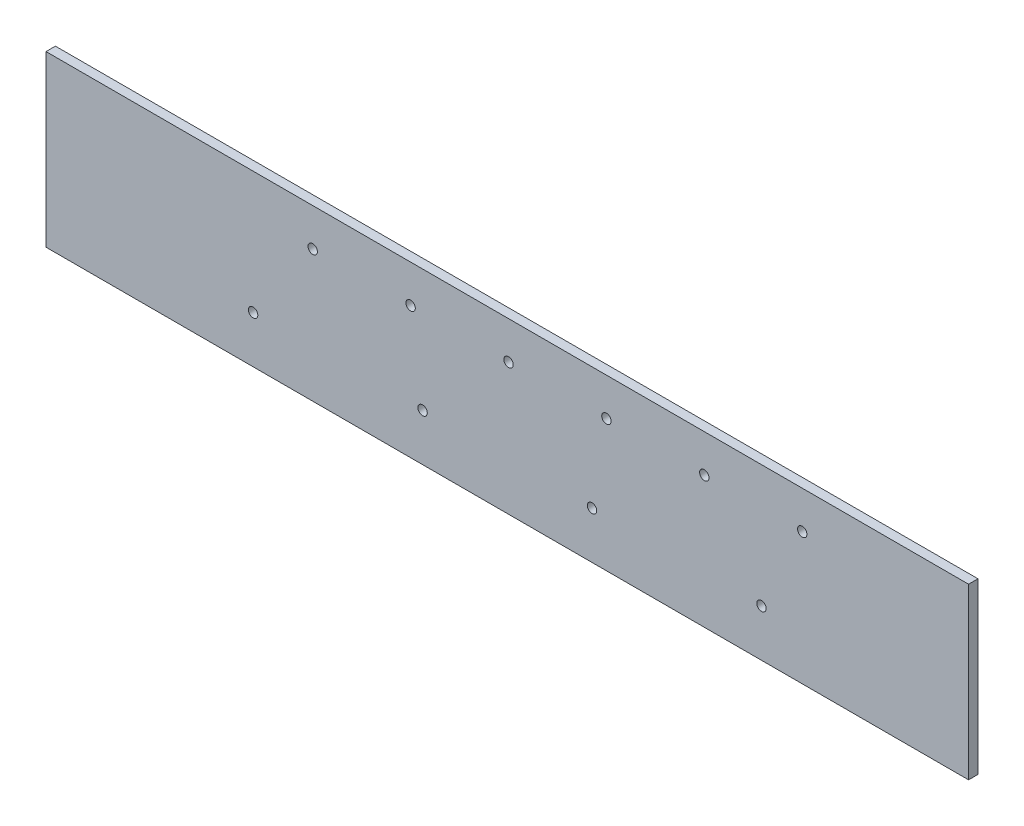
ISO-10303-21;
HEADER;
FILE_DESCRIPTION(('STEP AP214'),'2;1');
FILE_NAME('part.step','',(''),(''),'','','');
FILE_SCHEMA(('AUTOMOTIVE_DESIGN { 1 0 10303 214 1 1 1 1 }'));
ENDSEC;
DATA;
#1=APPLICATION_CONTEXT('core data for automotive mechanical design processes');
#2=APPLICATION_PROTOCOL_DEFINITION('international standard','automotive_design',2000,#1);
#3=PRODUCT_CONTEXT('',#1,'mechanical');
#4=PRODUCT('Part','Part','',(#3));
#5=PRODUCT_RELATED_PRODUCT_CATEGORY('part','',(#4));
#6=PRODUCT_DEFINITION_FORMATION('','',#4);
#7=PRODUCT_DEFINITION_CONTEXT('part definition',#1,'design');
#8=PRODUCT_DEFINITION('design','',#6,#7);
#9=PRODUCT_DEFINITION_SHAPE('','',#8);
#10=(LENGTH_UNIT() NAMED_UNIT(*) SI_UNIT(.MILLI.,.METRE.));
#11=(NAMED_UNIT(*) PLANE_ANGLE_UNIT() SI_UNIT($,.RADIAN.));
#12=(NAMED_UNIT(*) SI_UNIT($,.STERADIAN.) SOLID_ANGLE_UNIT());
#13=UNCERTAINTY_MEASURE_WITH_UNIT(LENGTH_MEASURE(1.E-05),#10,'distance_accuracy_value','');
#14=(GEOMETRIC_REPRESENTATION_CONTEXT(3) GLOBAL_UNCERTAINTY_ASSIGNED_CONTEXT((#13)) GLOBAL_UNIT_ASSIGNED_CONTEXT((#10,
#11,#12)) REPRESENTATION_CONTEXT('',''));
#15=CARTESIAN_POINT('',(0.,0.,0.));
#16=DIRECTION('',(0.,0.,1.));
#17=DIRECTION('',(1.,0.,0.));
#18=AXIS2_PLACEMENT_3D('',#15,#16,#17);
#19=CARTESIAN_POINT('',(171.450000000007,31.75,463.549999999998));
#20=DIRECTION('',(0.,0.,1.));
#21=DIRECTION('',(1.,0.,0.));
#22=AXIS2_PLACEMENT_3D('',#19,#20,#21);
#23=CYLINDRICAL_SURFACE('',#22,3.17499999999998);
#24=CARTESIAN_POINT('',(171.450000000007,31.75,457.199999999998));
#25=DIRECTION('',(0.,0.,1.));
#26=DIRECTION('',(1.,0.,0.));
#27=AXIS2_PLACEMENT_3D('',#24,#25,#26);
#28=CIRCLE('',#27,3.17499999999998);
#29=CARTESIAN_POINT('',(174.625000000007,31.75,457.199999999998));
#30=VERTEX_POINT('',#29);
#31=EDGE_CURVE('E49',#30,#30,#28,.T.);
#32=ORIENTED_EDGE('',*,*,#31,.F.);
#33=EDGE_LOOP('',(#32));
#34=FACE_BOUND('',#33,.T.);
#35=CARTESIAN_POINT('',(171.450000000007,31.75,463.549999999998));
#36=DIRECTION('',(0.,0.,1.));
#37=DIRECTION('',(1.,0.,0.));
#38=AXIS2_PLACEMENT_3D('',#35,#36,#37);
#39=CIRCLE('',#38,3.17499999999998);
#40=CARTESIAN_POINT('',(174.625000000007,31.75,463.549999999998));
#41=VERTEX_POINT('',#40);
#42=EDGE_CURVE('E11',#41,#41,#39,.T.);
#43=ORIENTED_EDGE('',*,*,#42,.T.);
#44=EDGE_LOOP('',(#43));
#45=FACE_BOUND('',#44,.T.);
#46=ADVANCED_FACE('F41',(#34,#45),#23,.F.);
#47=CARTESIAN_POINT('',(57.1500000000069,31.75,463.549999999998));
#48=DIRECTION('',(0.,0.,1.));
#49=DIRECTION('',(1.,0.,0.));
#50=AXIS2_PLACEMENT_3D('',#47,#48,#49);
#51=CYLINDRICAL_SURFACE('',#50,3.17499999999998);
#52=CARTESIAN_POINT('',(57.1500000000069,31.75,457.199999999998));
#53=DIRECTION('',(0.,0.,1.));
#54=DIRECTION('',(1.,0.,0.));
#55=AXIS2_PLACEMENT_3D('',#52,#53,#54);
#56=CIRCLE('',#55,3.17499999999998);
#57=CARTESIAN_POINT('',(60.3250000000069,31.75,457.199999999998));
#58=VERTEX_POINT('',#57);
#59=EDGE_CURVE('E143',#58,#58,#56,.T.);
#60=ORIENTED_EDGE('',*,*,#59,.F.);
#61=EDGE_LOOP('',(#60));
#62=FACE_BOUND('',#61,.T.);
#63=CARTESIAN_POINT('',(57.1500000000069,31.75,463.549999999998));
#64=DIRECTION('',(0.,0.,1.));
#65=DIRECTION('',(1.,0.,0.));
#66=AXIS2_PLACEMENT_3D('',#63,#64,#65);
#67=CIRCLE('',#66,3.17499999999998);
#68=CARTESIAN_POINT('',(60.3250000000069,31.75,463.549999999998));
#69=VERTEX_POINT('',#68);
#70=EDGE_CURVE('E146',#69,#69,#67,.T.);
#71=ORIENTED_EDGE('',*,*,#70,.T.);
#72=EDGE_LOOP('',(#71));
#73=FACE_BOUND('',#72,.T.);
#74=ADVANCED_FACE('F155',(#62,#73),#51,.F.);
#75=CARTESIAN_POINT('',(198.940269696113,88.9,463.549999999998));
#76=DIRECTION('',(0.,0.,1.));
#77=DIRECTION('',(1.,0.,0.));
#78=AXIS2_PLACEMENT_3D('',#75,#76,#77);
#79=CYLINDRICAL_SURFACE('',#78,3.17499999999998);
#80=CARTESIAN_POINT('',(198.940269696113,88.9,457.199999999998));
#81=DIRECTION('',(0.,0.,1.));
#82=DIRECTION('',(1.,0.,0.));
#83=AXIS2_PLACEMENT_3D('',#80,#81,#82);
#84=CIRCLE('',#83,3.17499999999998);
#85=CARTESIAN_POINT('',(202.115269696113,88.9,457.199999999998));
#86=VERTEX_POINT('',#85);
#87=EDGE_CURVE('E137',#86,#86,#84,.T.);
#88=ORIENTED_EDGE('',*,*,#87,.F.);
#89=EDGE_LOOP('',(#88));
#90=FACE_BOUND('',#89,.T.);
#91=CARTESIAN_POINT('',(198.940269696113,88.9,463.549999999998));
#92=DIRECTION('',(0.,0.,1.));
#93=DIRECTION('',(1.,0.,0.));
#94=AXIS2_PLACEMENT_3D('',#91,#92,#93);
#95=CIRCLE('',#94,3.17499999999998);
#96=CARTESIAN_POINT('',(202.115269696113,88.9,463.549999999998));
#97=VERTEX_POINT('',#96);
#98=EDGE_CURVE('E140',#97,#97,#95,.T.);
#99=ORIENTED_EDGE('',*,*,#98,.T.);
#100=EDGE_LOOP('',(#99));
#101=FACE_BOUND('',#100,.T.);
#102=ADVANCED_FACE('F195',(#90,#101),#79,.F.);
#103=CARTESIAN_POINT('',(132.900269696113,88.9,463.549999999998));
#104=DIRECTION('',(0.,0.,1.));
#105=DIRECTION('',(1.,0.,0.));
#106=AXIS2_PLACEMENT_3D('',#103,#104,#105);
#107=CYLINDRICAL_SURFACE('',#106,3.17499999999998);
#108=CARTESIAN_POINT('',(132.900269696113,88.9,457.199999999998));
#109=DIRECTION('',(0.,0.,1.));
#110=DIRECTION('',(1.,0.,0.));
#111=AXIS2_PLACEMENT_3D('',#108,#109,#110);
#112=CIRCLE('',#111,3.17499999999998);
#113=CARTESIAN_POINT('',(136.075269696113,88.9,457.199999999998));
#114=VERTEX_POINT('',#113);
#115=EDGE_CURVE('E131',#114,#114,#112,.T.);
#116=ORIENTED_EDGE('',*,*,#115,.F.);
#117=EDGE_LOOP('',(#116));
#118=FACE_BOUND('',#117,.T.);
#119=CARTESIAN_POINT('',(132.900269696113,88.9,463.549999999998));
#120=DIRECTION('',(0.,0.,1.));
#121=DIRECTION('',(1.,0.,0.));
#122=AXIS2_PLACEMENT_3D('',#119,#120,#121);
#123=CIRCLE('',#122,3.17499999999998);
#124=CARTESIAN_POINT('',(136.075269696113,88.9,463.549999999998));
#125=VERTEX_POINT('',#124);
#126=EDGE_CURVE('E134',#125,#125,#123,.T.);
#127=ORIENTED_EDGE('',*,*,#126,.T.);
#128=EDGE_LOOP('',(#127));
#129=FACE_BOUND('',#128,.T.);
#130=ADVANCED_FACE('F191',(#118,#129),#107,.F.);
#131=CARTESIAN_POINT('',(66.860269696113,88.9,463.549999999998));
#132=DIRECTION('',(0.,0.,1.));
#133=DIRECTION('',(1.,0.,0.));
#134=AXIS2_PLACEMENT_3D('',#131,#132,#133);
#135=CYLINDRICAL_SURFACE('',#134,3.17499999999998);
#136=CARTESIAN_POINT('',(66.860269696113,88.9,457.199999999998));
#137=DIRECTION('',(0.,0.,1.));
#138=DIRECTION('',(1.,0.,0.));
#139=AXIS2_PLACEMENT_3D('',#136,#137,#138);
#140=CIRCLE('',#139,3.17499999999998);
#141=CARTESIAN_POINT('',(70.035269696113,88.9,457.199999999998));
#142=VERTEX_POINT('',#141);
#143=EDGE_CURVE('E125',#142,#142,#140,.T.);
#144=ORIENTED_EDGE('',*,*,#143,.F.);
#145=EDGE_LOOP('',(#144));
#146=FACE_BOUND('',#145,.T.);
#147=CARTESIAN_POINT('',(66.860269696113,88.9,463.549999999998));
#148=DIRECTION('',(0.,0.,1.));
#149=DIRECTION('',(1.,0.,0.));
#150=AXIS2_PLACEMENT_3D('',#147,#148,#149);
#151=CIRCLE('',#150,3.17499999999998);
#152=CARTESIAN_POINT('',(70.035269696113,88.9,463.549999999998));
#153=VERTEX_POINT('',#152);
#154=EDGE_CURVE('E128',#153,#153,#151,.T.);
#155=ORIENTED_EDGE('',*,*,#154,.T.);
#156=EDGE_LOOP('',(#155));
#157=FACE_BOUND('',#156,.T.);
#158=ADVANCED_FACE('F187',(#146,#157),#135,.F.);
#159=CARTESIAN_POINT('',(0.820269696112957,88.9,463.549999999998));
#160=DIRECTION('',(0.,0.,1.));
#161=DIRECTION('',(1.,0.,0.));
#162=AXIS2_PLACEMENT_3D('',#159,#160,#161);
#163=CYLINDRICAL_SURFACE('',#162,3.17499999999998);
#164=CARTESIAN_POINT('',(0.820269696112957,88.9,457.199999999998));
#165=DIRECTION('',(0.,0.,1.));
#166=DIRECTION('',(1.,0.,0.));
#167=AXIS2_PLACEMENT_3D('',#164,#165,#166);
#168=CIRCLE('',#167,3.17499999999998);
#169=CARTESIAN_POINT('',(3.99526969611294,88.9,457.199999999998));
#170=VERTEX_POINT('',#169);
#171=EDGE_CURVE('E119',#170,#170,#168,.T.);
#172=ORIENTED_EDGE('',*,*,#171,.F.);
#173=EDGE_LOOP('',(#172));
#174=FACE_BOUND('',#173,.T.);
#175=CARTESIAN_POINT('',(0.820269696112957,88.9,463.549999999998));
#176=DIRECTION('',(0.,0.,1.));
#177=DIRECTION('',(1.,0.,0.));
#178=AXIS2_PLACEMENT_3D('',#175,#176,#177);
#179=CIRCLE('',#178,3.17499999999998);
#180=CARTESIAN_POINT('',(3.99526969611294,88.9,463.549999999998));
#181=VERTEX_POINT('',#180);
#182=EDGE_CURVE('E122',#181,#181,#179,.T.);
#183=ORIENTED_EDGE('',*,*,#182,.T.);
#184=EDGE_LOOP('',(#183));
#185=FACE_BOUND('',#184,.T.);
#186=ADVANCED_FACE('F183',(#174,#185),#163,.F.);
#187=CARTESIAN_POINT('',(-311.149999999993,114.3,463.549999999998));
#188=DIRECTION('',(1.,0.,0.));
#189=DIRECTION('',(0.,0.,-1.));
#190=AXIS2_PLACEMENT_3D('',#187,#188,#189);
#191=PLANE('',#190);
#192=DIRECTION('',(0.,-1.,0.));
#193=VECTOR('',#192,1.);
#194=CARTESIAN_POINT('',(-311.149999999993,114.3,457.199999999998));
#195=LINE('',#194,#193);
#196=CARTESIAN_POINT('',(-311.149999999993,114.3,457.199999999998));
#197=VERTEX_POINT('',#196);
#198=CARTESIAN_POINT('',(-311.149999999993,0.,457.199999999998));
#199=VERTEX_POINT('',#198);
#200=EDGE_CURVE('E109',#197,#199,#195,.T.);
#201=ORIENTED_EDGE('',*,*,#200,.T.);
#202=DIRECTION('',(0.,0.,-1.));
#203=VECTOR('',#202,1.);
#204=CARTESIAN_POINT('',(-311.149999999993,0.,463.549999999998));
#205=LINE('',#204,#203);
#206=CARTESIAN_POINT('',(-311.149999999993,0.,463.549999999998));
#207=VERTEX_POINT('',#206);
#208=EDGE_CURVE('E100',#207,#199,#205,.T.);
#209=ORIENTED_EDGE('',*,*,#208,.F.);
#210=DIRECTION('',(0.,-1.,0.));
#211=VECTOR('',#210,1.);
#212=CARTESIAN_POINT('',(-311.149999999993,114.3,463.549999999998));
#213=LINE('',#212,#211);
#214=CARTESIAN_POINT('',(-311.149999999993,114.3,463.549999999998));
#215=VERTEX_POINT('',#214);
#216=EDGE_CURVE('E94',#215,#207,#213,.T.);
#217=ORIENTED_EDGE('',*,*,#216,.F.);
#218=DIRECTION('',(0.,0.,-1.));
#219=VECTOR('',#218,1.);
#220=CARTESIAN_POINT('',(-311.149999999993,114.3,463.549999999998));
#221=LINE('',#220,#219);
#222=EDGE_CURVE('E105',#215,#197,#221,.T.);
#223=ORIENTED_EDGE('',*,*,#222,.T.);
#224=EDGE_LOOP('',(#201,#209,#217,#223));
#225=FACE_BOUND('',#224,.T.);
#226=ADVANCED_FACE('F180',(#225),#191,.F.);
#227=CARTESIAN_POINT('',(-311.149999999993,0.,463.549999999998));
#228=DIRECTION('',(0.,1.,0.));
#229=DIRECTION('',(0.,0.,1.));
#230=AXIS2_PLACEMENT_3D('',#227,#228,#229);
#231=PLANE('',#230);
#232=DIRECTION('',(1.,0.,0.));
#233=VECTOR('',#232,1.);
#234=CARTESIAN_POINT('',(-311.149999999993,0.,457.199999999998));
#235=LINE('',#234,#233);
#236=CARTESIAN_POINT('',(311.150000000007,0.,457.199999999998));
#237=VERTEX_POINT('',#236);
#238=EDGE_CURVE('E99',#199,#237,#235,.T.);
#239=ORIENTED_EDGE('',*,*,#238,.T.);
#240=DIRECTION('',(0.,0.,-1.));
#241=VECTOR('',#240,1.);
#242=CARTESIAN_POINT('',(311.150000000007,0.,463.549999999998));
#243=LINE('',#242,#241);
#244=CARTESIAN_POINT('',(311.150000000007,0.,463.549999999998));
#245=VERTEX_POINT('',#244);
#246=EDGE_CURVE('E97',#245,#237,#243,.T.);
#247=ORIENTED_EDGE('',*,*,#246,.F.);
#248=DIRECTION('',(1.,0.,0.));
#249=VECTOR('',#248,1.);
#250=CARTESIAN_POINT('',(-311.149999999993,0.,463.549999999998));
#251=LINE('',#250,#249);
#252=EDGE_CURVE('E88',#207,#245,#251,.T.);
#253=ORIENTED_EDGE('',*,*,#252,.F.);
#254=ORIENTED_EDGE('',*,*,#208,.T.);
#255=EDGE_LOOP('',(#239,#247,#253,#254));
#256=FACE_BOUND('',#255,.T.);
#257=ADVANCED_FACE('F98',(#256),#231,.F.);
#258=CARTESIAN_POINT('',(311.150000000007,114.3,463.549999999998));
#259=DIRECTION('',(-1.,0.,0.));
#260=DIRECTION('',(0.,0.,1.));
#261=AXIS2_PLACEMENT_3D('',#258,#259,#260);
#262=PLANE('',#261);
#263=DIRECTION('',(0.,1.,0.));
#264=VECTOR('',#263,1.);
#265=CARTESIAN_POINT('',(311.150000000007,114.3,457.199999999998));
#266=LINE('',#265,#264);
#267=CARTESIAN_POINT('',(311.150000000007,114.3,457.199999999998));
#268=VERTEX_POINT('',#267);
#269=EDGE_CURVE('E74',#237,#268,#266,.T.);
#270=ORIENTED_EDGE('',*,*,#269,.T.);
#271=DIRECTION('',(0.,0.,-1.));
#272=VECTOR('',#271,1.);
#273=CARTESIAN_POINT('',(311.150000000007,114.3,463.549999999998));
#274=LINE('',#273,#272);
#275=CARTESIAN_POINT('',(311.150000000007,114.3,463.549999999998));
#276=VERTEX_POINT('',#275);
#277=EDGE_CURVE('E101',#276,#268,#274,.T.);
#278=ORIENTED_EDGE('',*,*,#277,.F.);
#279=DIRECTION('',(0.,1.,0.));
#280=VECTOR('',#279,1.);
#281=CARTESIAN_POINT('',(311.150000000007,114.3,463.549999999998));
#282=LINE('',#281,#280);
#283=EDGE_CURVE('E92',#245,#276,#282,.T.);
#284=ORIENTED_EDGE('',*,*,#283,.F.);
#285=ORIENTED_EDGE('',*,*,#246,.T.);
#286=EDGE_LOOP('',(#270,#278,#284,#285));
#287=FACE_BOUND('',#286,.T.);
#288=ADVANCED_FACE('F103',(#287),#262,.F.);
#289=CARTESIAN_POINT('',(-311.149999999993,114.3,463.549999999998));
#290=DIRECTION('',(0.,-1.,0.));
#291=DIRECTION('',(0.,0.,-1.));
#292=AXIS2_PLACEMENT_3D('',#289,#290,#291);
#293=PLANE('',#292);
#294=DIRECTION('',(-1.,0.,0.));
#295=VECTOR('',#294,1.);
#296=CARTESIAN_POINT('',(-311.149999999993,114.3,457.199999999998));
#297=LINE('',#296,#295);
#298=EDGE_CURVE('E80',#268,#197,#297,.T.);
#299=ORIENTED_EDGE('',*,*,#298,.T.);
#300=ORIENTED_EDGE('',*,*,#222,.F.);
#301=DIRECTION('',(-1.,0.,0.));
#302=VECTOR('',#301,1.);
#303=CARTESIAN_POINT('',(-311.149999999993,114.3,463.549999999998));
#304=LINE('',#303,#302);
#305=EDGE_CURVE('E57',#276,#215,#304,.T.);
#306=ORIENTED_EDGE('',*,*,#305,.F.);
#307=ORIENTED_EDGE('',*,*,#277,.T.);
#308=EDGE_LOOP('',(#299,#300,#306,#307));
#309=FACE_BOUND('',#308,.T.);
#310=ADVANCED_FACE('F159',(#309),#293,.F.);
#311=CARTESIAN_POINT('',(0.,0.,463.549999999998));
#312=DIRECTION('',(0.,0.,1.));
#313=DIRECTION('',(1.,0.,0.));
#314=AXIS2_PLACEMENT_3D('',#311,#312,#313);
#315=PLANE('',#314);
#316=CARTESIAN_POINT('',(-57.1499999999931,31.75,463.549999999998));
#317=DIRECTION('',(0.,0.,1.));
#318=DIRECTION('',(1.,0.,0.));
#319=AXIS2_PLACEMENT_3D('',#316,#317,#318);
#320=CIRCLE('',#319,3.17499999999998);
#321=CARTESIAN_POINT('',(-53.9749999999931,31.75,463.549999999998));
#322=VERTEX_POINT('',#321);
#323=EDGE_CURVE('E317',#322,#322,#320,.T.);
#324=ORIENTED_EDGE('',*,*,#323,.F.);
#325=EDGE_LOOP('',(#324));
#326=FACE_BOUND('',#325,.T.);
#327=CARTESIAN_POINT('',(-171.449999999993,31.75,463.549999999998));
#328=DIRECTION('',(0.,0.,1.));
#329=DIRECTION('',(1.,0.,0.));
#330=AXIS2_PLACEMENT_3D('',#327,#328,#329);
#331=CIRCLE('',#330,3.17499999999998);
#332=CARTESIAN_POINT('',(-168.274999999993,31.75,463.549999999998));
#333=VERTEX_POINT('',#332);
#334=EDGE_CURVE('E318',#333,#333,#331,.T.);
#335=ORIENTED_EDGE('',*,*,#334,.F.);
#336=EDGE_LOOP('',(#335));
#337=FACE_BOUND('',#336,.T.);
#338=CARTESIAN_POINT('',(-65.219730303887,88.9,463.549999999998));
#339=DIRECTION('',(0.,0.,1.));
#340=DIRECTION('',(1.,0.,0.));
#341=AXIS2_PLACEMENT_3D('',#338,#339,#340);
#342=CIRCLE('',#341,3.17499999999998);
#343=CARTESIAN_POINT('',(-62.0447303038871,88.9,463.549999999998));
#344=VERTEX_POINT('',#343);
#345=EDGE_CURVE('E330',#344,#344,#342,.T.);
#346=ORIENTED_EDGE('',*,*,#345,.F.);
#347=EDGE_LOOP('',(#346));
#348=FACE_BOUND('',#347,.T.);
#349=CARTESIAN_POINT('',(-131.259730303887,88.9,463.549999999998));
#350=DIRECTION('',(0.,0.,1.));
#351=DIRECTION('',(1.,0.,0.));
#352=AXIS2_PLACEMENT_3D('',#349,#350,#351);
#353=CIRCLE('',#352,3.17499999999998);
#354=CARTESIAN_POINT('',(-128.084730303887,88.9,463.549999999998));
#355=VERTEX_POINT('',#354);
#356=EDGE_CURVE('E333',#355,#355,#353,.T.);
#357=ORIENTED_EDGE('',*,*,#356,.F.);
#358=EDGE_LOOP('',(#357));
#359=FACE_BOUND('',#358,.T.);
#360=ORIENTED_EDGE('',*,*,#216,.T.);
#361=ORIENTED_EDGE('',*,*,#252,.T.);
#362=ORIENTED_EDGE('',*,*,#283,.T.);
#363=ORIENTED_EDGE('',*,*,#305,.T.);
#364=EDGE_LOOP('',(#360,#361,#362,#363));
#365=FACE_BOUND('',#364,.T.);
#366=ORIENTED_EDGE('',*,*,#182,.F.);
#367=EDGE_LOOP('',(#366));
#368=FACE_BOUND('',#367,.T.);
#369=ORIENTED_EDGE('',*,*,#154,.F.);
#370=EDGE_LOOP('',(#369));
#371=FACE_BOUND('',#370,.T.);
#372=ORIENTED_EDGE('',*,*,#126,.F.);
#373=EDGE_LOOP('',(#372));
#374=FACE_BOUND('',#373,.T.);
#375=ORIENTED_EDGE('',*,*,#98,.F.);
#376=EDGE_LOOP('',(#375));
#377=FACE_BOUND('',#376,.T.);
#378=ORIENTED_EDGE('',*,*,#70,.F.);
#379=EDGE_LOOP('',(#378));
#380=FACE_BOUND('',#379,.T.);
#381=ORIENTED_EDGE('',*,*,#42,.F.);
#382=EDGE_LOOP('',(#381));
#383=FACE_BOUND('',#382,.T.);
#384=ADVANCED_FACE('F89',(#326,#337,#348,#359,#365,#368,#371,#374,#377,#380,#383),#315,.T.);
#385=CARTESIAN_POINT('',(0.,0.,457.199999999998));
#386=DIRECTION('',(0.,0.,1.));
#387=DIRECTION('',(1.,0.,0.));
#388=AXIS2_PLACEMENT_3D('',#385,#386,#387);
#389=PLANE('',#388);
#390=CARTESIAN_POINT('',(-57.1499999999931,31.75,457.199999999998));
#391=DIRECTION('',(0.,0.,1.));
#392=DIRECTION('',(1.,0.,0.));
#393=AXIS2_PLACEMENT_3D('',#390,#391,#392);
#394=CIRCLE('',#393,3.17499999999998);
#395=CARTESIAN_POINT('',(-53.9749999999931,31.75,457.199999999998));
#396=VERTEX_POINT('',#395);
#397=EDGE_CURVE('E315',#396,#396,#394,.T.);
#398=ORIENTED_EDGE('',*,*,#397,.T.);
#399=EDGE_LOOP('',(#398));
#400=FACE_BOUND('',#399,.T.);
#401=CARTESIAN_POINT('',(-171.449999999993,31.75,457.199999999998));
#402=DIRECTION('',(0.,0.,1.));
#403=DIRECTION('',(1.,0.,0.));
#404=AXIS2_PLACEMENT_3D('',#401,#402,#403);
#405=CIRCLE('',#404,3.17499999999998);
#406=CARTESIAN_POINT('',(-168.274999999993,31.75,457.199999999998));
#407=VERTEX_POINT('',#406);
#408=EDGE_CURVE('E321',#407,#407,#405,.T.);
#409=ORIENTED_EDGE('',*,*,#408,.T.);
#410=EDGE_LOOP('',(#409));
#411=FACE_BOUND('',#410,.T.);
#412=CARTESIAN_POINT('',(-65.219730303887,88.9,457.199999999998));
#413=DIRECTION('',(0.,0.,1.));
#414=DIRECTION('',(1.,0.,0.));
#415=AXIS2_PLACEMENT_3D('',#412,#413,#414);
#416=CIRCLE('',#415,3.17499999999998);
#417=CARTESIAN_POINT('',(-62.0447303038871,88.9,457.199999999998));
#418=VERTEX_POINT('',#417);
#419=EDGE_CURVE('E327',#418,#418,#416,.T.);
#420=ORIENTED_EDGE('',*,*,#419,.T.);
#421=EDGE_LOOP('',(#420));
#422=FACE_BOUND('',#421,.T.);
#423=CARTESIAN_POINT('',(-131.259730303887,88.9,457.199999999998));
#424=DIRECTION('',(0.,0.,1.));
#425=DIRECTION('',(1.,0.,0.));
#426=AXIS2_PLACEMENT_3D('',#423,#424,#425);
#427=CIRCLE('',#426,3.17499999999998);
#428=CARTESIAN_POINT('',(-128.084730303887,88.9,457.199999999998));
#429=VERTEX_POINT('',#428);
#430=EDGE_CURVE('E112',#429,#429,#427,.T.);
#431=ORIENTED_EDGE('',*,*,#430,.T.);
#432=EDGE_LOOP('',(#431));
#433=FACE_BOUND('',#432,.T.);
#434=ORIENTED_EDGE('',*,*,#200,.F.);
#435=ORIENTED_EDGE('',*,*,#298,.F.);
#436=ORIENTED_EDGE('',*,*,#269,.F.);
#437=ORIENTED_EDGE('',*,*,#238,.F.);
#438=EDGE_LOOP('',(#434,#435,#436,#437));
#439=FACE_BOUND('',#438,.T.);
#440=ORIENTED_EDGE('',*,*,#171,.T.);
#441=EDGE_LOOP('',(#440));
#442=FACE_BOUND('',#441,.T.);
#443=ORIENTED_EDGE('',*,*,#143,.T.);
#444=EDGE_LOOP('',(#443));
#445=FACE_BOUND('',#444,.T.);
#446=ORIENTED_EDGE('',*,*,#115,.T.);
#447=EDGE_LOOP('',(#446));
#448=FACE_BOUND('',#447,.T.);
#449=ORIENTED_EDGE('',*,*,#87,.T.);
#450=EDGE_LOOP('',(#449));
#451=FACE_BOUND('',#450,.T.);
#452=ORIENTED_EDGE('',*,*,#59,.T.);
#453=EDGE_LOOP('',(#452));
#454=FACE_BOUND('',#453,.T.);
#455=ORIENTED_EDGE('',*,*,#31,.T.);
#456=EDGE_LOOP('',(#455));
#457=FACE_BOUND('',#456,.T.);
#458=ADVANCED_FACE('F151',(#400,#411,#422,#433,#439,#442,#445,#448,#451,#454,#457),#389,.F.);
#459=CARTESIAN_POINT('',(-131.259730303887,88.9,463.549999999998));
#460=DIRECTION('',(0.,0.,1.));
#461=DIRECTION('',(1.,0.,0.));
#462=AXIS2_PLACEMENT_3D('',#459,#460,#461);
#463=CYLINDRICAL_SURFACE('',#462,3.17499999999998);
#464=ORIENTED_EDGE('',*,*,#430,.F.);
#465=EDGE_LOOP('',(#464));
#466=FACE_BOUND('',#465,.T.);
#467=ORIENTED_EDGE('',*,*,#356,.T.);
#468=EDGE_LOOP('',(#467));
#469=FACE_BOUND('',#468,.T.);
#470=ADVANCED_FACE('F166',(#466,#469),#463,.F.);
#471=CARTESIAN_POINT('',(-65.219730303887,88.9,463.549999999998));
#472=DIRECTION('',(0.,0.,1.));
#473=DIRECTION('',(1.,0.,0.));
#474=AXIS2_PLACEMENT_3D('',#471,#472,#473);
#475=CYLINDRICAL_SURFACE('',#474,3.17499999999998);
#476=ORIENTED_EDGE('',*,*,#419,.F.);
#477=EDGE_LOOP('',(#476));
#478=FACE_BOUND('',#477,.T.);
#479=ORIENTED_EDGE('',*,*,#345,.T.);
#480=EDGE_LOOP('',(#479));
#481=FACE_BOUND('',#480,.T.);
#482=ADVANCED_FACE('F222',(#478,#481),#475,.F.);
#483=CARTESIAN_POINT('',(-171.449999999993,31.75,463.549999999998));
#484=DIRECTION('',(0.,0.,1.));
#485=DIRECTION('',(1.,0.,0.));
#486=AXIS2_PLACEMENT_3D('',#483,#484,#485);
#487=CYLINDRICAL_SURFACE('',#486,3.17499999999998);
#488=ORIENTED_EDGE('',*,*,#408,.F.);
#489=EDGE_LOOP('',(#488));
#490=FACE_BOUND('',#489,.T.);
#491=ORIENTED_EDGE('',*,*,#334,.T.);
#492=EDGE_LOOP('',(#491));
#493=FACE_BOUND('',#492,.T.);
#494=ADVANCED_FACE('F218',(#490,#493),#487,.F.);
#495=CARTESIAN_POINT('',(-57.1499999999931,31.75,463.549999999998));
#496=DIRECTION('',(0.,0.,1.));
#497=DIRECTION('',(1.,0.,0.));
#498=AXIS2_PLACEMENT_3D('',#495,#496,#497);
#499=CYLINDRICAL_SURFACE('',#498,3.17499999999998);
#500=ORIENTED_EDGE('',*,*,#397,.F.);
#501=EDGE_LOOP('',(#500));
#502=FACE_BOUND('',#501,.T.);
#503=ORIENTED_EDGE('',*,*,#323,.T.);
#504=EDGE_LOOP('',(#503));
#505=FACE_BOUND('',#504,.T.);
#506=ADVANCED_FACE('F221',(#502,#505),#499,.F.);
#507=CLOSED_SHELL('',(#46,#74,#102,#130,#158,#186,#226,#257,#288,#310,#384,#458,#470,#482,#494,#506));
#508=MANIFOLD_SOLID_BREP('B2',#507);
#509=ADVANCED_BREP_SHAPE_REPRESENTATION('',(#18,#508),#14);
#510=SHAPE_DEFINITION_REPRESENTATION(#9,#509);
ENDSEC;
END-ISO-10303-21;
